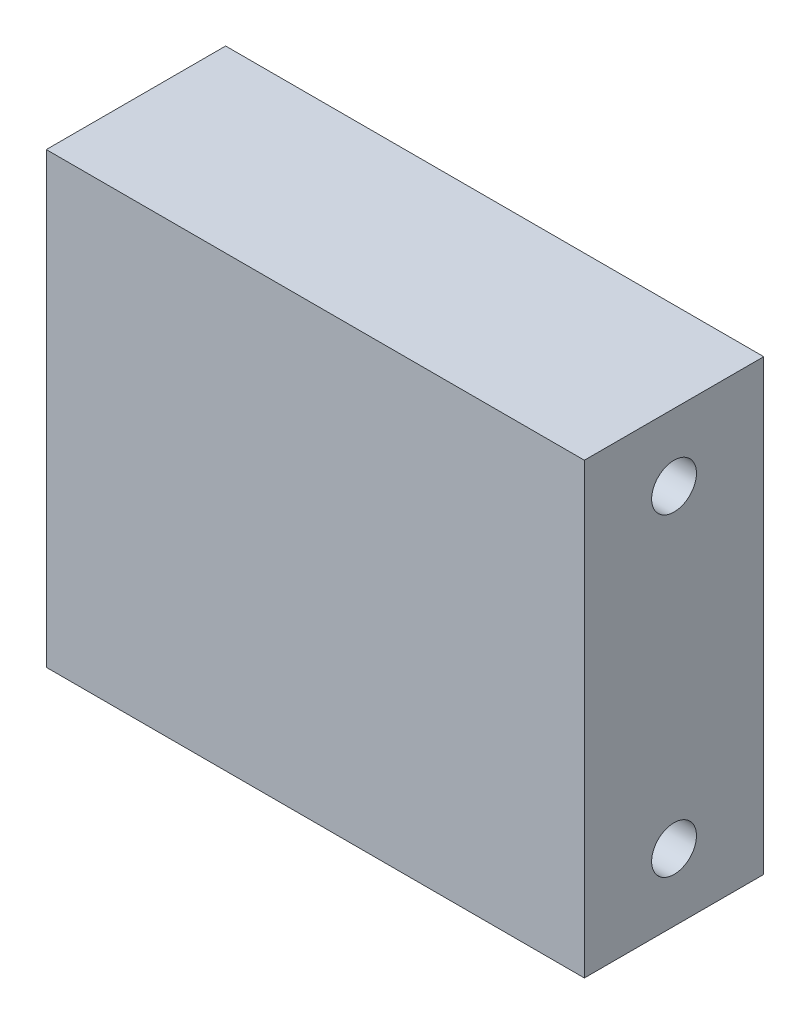
ISO-10303-21;
HEADER;
FILE_DESCRIPTION(('STEP AP214'),'2;1');
FILE_NAME('part.step','',(''),(''),'','','');
FILE_SCHEMA(('AUTOMOTIVE_DESIGN { 1 0 10303 214 1 1 1 1 }'));
ENDSEC;
DATA;
#1=APPLICATION_CONTEXT('core data for automotive mechanical design processes');
#2=APPLICATION_PROTOCOL_DEFINITION('international standard','automotive_design',2000,#1);
#3=PRODUCT_CONTEXT('',#1,'mechanical');
#4=PRODUCT('Part','Part','',(#3));
#5=PRODUCT_RELATED_PRODUCT_CATEGORY('part','',(#4));
#6=PRODUCT_DEFINITION_FORMATION('','',#4);
#7=PRODUCT_DEFINITION_CONTEXT('part definition',#1,'design');
#8=PRODUCT_DEFINITION('design','',#6,#7);
#9=PRODUCT_DEFINITION_SHAPE('','',#8);
#10=(LENGTH_UNIT() NAMED_UNIT(*) SI_UNIT(.MILLI.,.METRE.));
#11=(NAMED_UNIT(*) PLANE_ANGLE_UNIT() SI_UNIT($,.RADIAN.));
#12=(NAMED_UNIT(*) SI_UNIT($,.STERADIAN.) SOLID_ANGLE_UNIT());
#13=UNCERTAINTY_MEASURE_WITH_UNIT(LENGTH_MEASURE(1.E-05),#10,'distance_accuracy_value','');
#14=(GEOMETRIC_REPRESENTATION_CONTEXT(3) GLOBAL_UNCERTAINTY_ASSIGNED_CONTEXT((#13)) GLOBAL_UNIT_ASSIGNED_CONTEXT((#10,
#11,#12)) REPRESENTATION_CONTEXT('',''));
#15=CARTESIAN_POINT('',(0.,0.,0.));
#16=DIRECTION('',(0.,0.,1.));
#17=DIRECTION('',(1.,0.,0.));
#18=AXIS2_PLACEMENT_3D('',#15,#16,#17);
#19=CARTESIAN_POINT('',(0.,127.,0.));
#20=DIRECTION('',(1.,0.,0.));
#21=DIRECTION('',(0.,0.,-1.));
#22=AXIS2_PLACEMENT_3D('',#19,#20,#21);
#23=PLANE('',#22);
#24=CARTESIAN_POINT('',(0.,19.05,-25.4));
#25=DIRECTION('',(-1.,0.,0.));
#26=DIRECTION('',(0.,0.,1.));
#27=AXIS2_PLACEMENT_3D('',#24,#25,#26);
#28=CIRCLE('',#27,6.35);
#29=CARTESIAN_POINT('',(0.,19.05,-19.05));
#30=VERTEX_POINT('',#29);
#31=EDGE_CURVE('E116',#30,#30,#28,.T.);
#32=ORIENTED_EDGE('',*,*,#31,.F.);
#33=EDGE_LOOP('',(#32));
#34=FACE_BOUND('',#33,.T.);
#35=CARTESIAN_POINT('',(0.,107.95,-25.4));
#36=DIRECTION('',(-1.,0.,0.));
#37=DIRECTION('',(0.,0.,-1.));
#38=AXIS2_PLACEMENT_3D('',#35,#36,#37);
#39=CIRCLE('',#38,6.35);
#40=CARTESIAN_POINT('',(0.,107.95,-31.75));
#41=VERTEX_POINT('',#40);
#42=EDGE_CURVE('E110',#41,#41,#39,.T.);
#43=ORIENTED_EDGE('',*,*,#42,.F.);
#44=EDGE_LOOP('',(#43));
#45=FACE_BOUND('',#44,.T.);
#46=DIRECTION('',(0.,0.,1.));
#47=VECTOR('',#46,1.);
#48=CARTESIAN_POINT('',(0.,0.,0.));
#49=LINE('',#48,#47);
#50=CARTESIAN_POINT('',(0.,0.,-50.8));
#51=VERTEX_POINT('',#50);
#52=CARTESIAN_POINT('',(0.,0.,0.));
#53=VERTEX_POINT('',#52);
#54=EDGE_CURVE('E96',#51,#53,#49,.T.);
#55=ORIENTED_EDGE('',*,*,#54,.T.);
#56=DIRECTION('',(0.,-1.,0.));
#57=VECTOR('',#56,1.);
#58=CARTESIAN_POINT('',(0.,127.,0.));
#59=LINE('',#58,#57);
#60=CARTESIAN_POINT('',(0.,127.,0.));
#61=VERTEX_POINT('',#60);
#62=EDGE_CURVE('E11',#61,#53,#59,.T.);
#63=ORIENTED_EDGE('',*,*,#62,.F.);
#64=DIRECTION('',(0.,0.,1.));
#65=VECTOR('',#64,1.);
#66=CARTESIAN_POINT('',(0.,127.,0.));
#67=LINE('',#66,#65);
#68=CARTESIAN_POINT('',(0.,127.,-50.8));
#69=VERTEX_POINT('',#68);
#70=EDGE_CURVE('E84',#69,#61,#67,.T.);
#71=ORIENTED_EDGE('',*,*,#70,.F.);
#72=DIRECTION('',(0.,-1.,0.));
#73=VECTOR('',#72,1.);
#74=CARTESIAN_POINT('',(0.,127.,-50.8));
#75=LINE('',#74,#73);
#76=EDGE_CURVE('E92',#69,#51,#75,.T.);
#77=ORIENTED_EDGE('',*,*,#76,.T.);
#78=EDGE_LOOP('',(#55,#63,#71,#77));
#79=FACE_BOUND('',#78,.T.);
#80=ADVANCED_FACE('F33',(#34,#45,#79),#23,.F.);
#81=CARTESIAN_POINT('',(0.,127.,0.));
#82=DIRECTION('',(0.,0.,-1.));
#83=DIRECTION('',(-1.,0.,0.));
#84=AXIS2_PLACEMENT_3D('',#81,#82,#83);
#85=PLANE('',#84);
#86=DIRECTION('',(1.,0.,0.));
#87=VECTOR('',#86,1.);
#88=CARTESIAN_POINT('',(0.,0.,0.));
#89=LINE('',#88,#87);
#90=CARTESIAN_POINT('',(152.4,0.,0.));
#91=VERTEX_POINT('',#90);
#92=EDGE_CURVE('E88',#53,#91,#89,.T.);
#93=ORIENTED_EDGE('',*,*,#92,.T.);
#94=DIRECTION('',(0.,-1.,0.));
#95=VECTOR('',#94,1.);
#96=CARTESIAN_POINT('',(152.4,127.,0.));
#97=LINE('',#96,#95);
#98=CARTESIAN_POINT('',(152.4,127.,0.));
#99=VERTEX_POINT('',#98);
#100=EDGE_CURVE('E41',#99,#91,#97,.T.);
#101=ORIENTED_EDGE('',*,*,#100,.F.);
#102=DIRECTION('',(1.,0.,0.));
#103=VECTOR('',#102,1.);
#104=CARTESIAN_POINT('',(0.,127.,0.));
#105=LINE('',#104,#103);
#106=EDGE_CURVE('E79',#61,#99,#105,.T.);
#107=ORIENTED_EDGE('',*,*,#106,.F.);
#108=ORIENTED_EDGE('',*,*,#62,.T.);
#109=EDGE_LOOP('',(#93,#101,#107,#108));
#110=FACE_BOUND('',#109,.T.);
#111=ADVANCED_FACE('F87',(#110),#85,.F.);
#112=CARTESIAN_POINT('',(152.4,127.,0.));
#113=DIRECTION('',(-1.,0.,0.));
#114=DIRECTION('',(0.,0.,1.));
#115=AXIS2_PLACEMENT_3D('',#112,#113,#114);
#116=PLANE('',#115);
#117=CARTESIAN_POINT('',(152.4,19.05,-25.4));
#118=DIRECTION('',(-1.,0.,0.));
#119=DIRECTION('',(0.,0.,1.));
#120=AXIS2_PLACEMENT_3D('',#117,#118,#119);
#121=CIRCLE('',#120,6.35);
#122=CARTESIAN_POINT('',(152.4,19.05,-19.05));
#123=VERTEX_POINT('',#122);
#124=EDGE_CURVE('E99',#123,#123,#121,.T.);
#125=ORIENTED_EDGE('',*,*,#124,.T.);
#126=EDGE_LOOP('',(#125));
#127=FACE_BOUND('',#126,.T.);
#128=CARTESIAN_POINT('',(152.4,107.95,-25.4));
#129=DIRECTION('',(-1.,0.,0.));
#130=DIRECTION('',(0.,0.,-1.));
#131=AXIS2_PLACEMENT_3D('',#128,#129,#130);
#132=CIRCLE('',#131,6.35);
#133=CARTESIAN_POINT('',(152.4,107.95,-31.75));
#134=VERTEX_POINT('',#133);
#135=EDGE_CURVE('E113',#134,#134,#132,.T.);
#136=ORIENTED_EDGE('',*,*,#135,.T.);
#137=EDGE_LOOP('',(#136));
#138=FACE_BOUND('',#137,.T.);
#139=DIRECTION('',(0.,0.,-1.));
#140=VECTOR('',#139,1.);
#141=CARTESIAN_POINT('',(152.4,0.,0.));
#142=LINE('',#141,#140);
#143=CARTESIAN_POINT('',(152.4,0.,-50.8));
#144=VERTEX_POINT('',#143);
#145=EDGE_CURVE('E66',#91,#144,#142,.T.);
#146=ORIENTED_EDGE('',*,*,#145,.T.);
#147=DIRECTION('',(0.,-1.,0.));
#148=VECTOR('',#147,1.);
#149=CARTESIAN_POINT('',(152.4,127.,-50.8));
#150=LINE('',#149,#148);
#151=CARTESIAN_POINT('',(152.4,127.,-50.8));
#152=VERTEX_POINT('',#151);
#153=EDGE_CURVE('E89',#152,#144,#150,.T.);
#154=ORIENTED_EDGE('',*,*,#153,.F.);
#155=DIRECTION('',(0.,0.,-1.));
#156=VECTOR('',#155,1.);
#157=CARTESIAN_POINT('',(152.4,127.,0.));
#158=LINE('',#157,#156);
#159=EDGE_CURVE('E82',#99,#152,#158,.T.);
#160=ORIENTED_EDGE('',*,*,#159,.F.);
#161=ORIENTED_EDGE('',*,*,#100,.T.);
#162=EDGE_LOOP('',(#146,#154,#160,#161));
#163=FACE_BOUND('',#162,.T.);
#164=ADVANCED_FACE('F90',(#127,#138,#163),#116,.F.);
#165=CARTESIAN_POINT('',(0.,127.,-50.8));
#166=DIRECTION('',(0.,0.,1.));
#167=DIRECTION('',(1.,0.,0.));
#168=AXIS2_PLACEMENT_3D('',#165,#166,#167);
#169=PLANE('',#168);
#170=DIRECTION('',(-1.,0.,0.));
#171=VECTOR('',#170,1.);
#172=CARTESIAN_POINT('',(0.,0.,-50.8));
#173=LINE('',#172,#171);
#174=EDGE_CURVE('E72',#144,#51,#173,.T.);
#175=ORIENTED_EDGE('',*,*,#174,.T.);
#176=ORIENTED_EDGE('',*,*,#76,.F.);
#177=DIRECTION('',(-1.,0.,0.));
#178=VECTOR('',#177,1.);
#179=CARTESIAN_POINT('',(0.,127.,-50.8));
#180=LINE('',#179,#178);
#181=EDGE_CURVE('E49',#152,#69,#180,.T.);
#182=ORIENTED_EDGE('',*,*,#181,.F.);
#183=ORIENTED_EDGE('',*,*,#153,.T.);
#184=EDGE_LOOP('',(#175,#176,#182,#183));
#185=FACE_BOUND('',#184,.T.);
#186=ADVANCED_FACE('F104',(#185),#169,.F.);
#187=CARTESIAN_POINT('',(0.,127.,0.));
#188=DIRECTION('',(0.,-1.,0.));
#189=DIRECTION('',(0.,0.,-1.));
#190=AXIS2_PLACEMENT_3D('',#187,#188,#189);
#191=PLANE('',#190);
#192=ORIENTED_EDGE('',*,*,#70,.T.);
#193=ORIENTED_EDGE('',*,*,#106,.T.);
#194=ORIENTED_EDGE('',*,*,#159,.T.);
#195=ORIENTED_EDGE('',*,*,#181,.T.);
#196=EDGE_LOOP('',(#192,#193,#194,#195));
#197=FACE_BOUND('',#196,.T.);
#198=ADVANCED_FACE('F80',(#197),#191,.F.);
#199=CARTESIAN_POINT('',(0.,0.,0.));
#200=DIRECTION('',(0.,-1.,0.));
#201=DIRECTION('',(0.,0.,-1.));
#202=AXIS2_PLACEMENT_3D('',#199,#200,#201);
#203=PLANE('',#202);
#204=ORIENTED_EDGE('',*,*,#54,.F.);
#205=ORIENTED_EDGE('',*,*,#174,.F.);
#206=ORIENTED_EDGE('',*,*,#145,.F.);
#207=ORIENTED_EDGE('',*,*,#92,.F.);
#208=EDGE_LOOP('',(#204,#205,#206,#207));
#209=FACE_BOUND('',#208,.T.);
#210=ADVANCED_FACE('F107',(#209),#203,.T.);
#211=CARTESIAN_POINT('',(152.4,107.95,-25.4));
#212=DIRECTION('',(-1.,0.,0.));
#213=DIRECTION('',(0.,0.,1.));
#214=AXIS2_PLACEMENT_3D('',#211,#212,#213);
#215=CYLINDRICAL_SURFACE('',#214,6.35);
#216=ORIENTED_EDGE('',*,*,#135,.F.);
#217=EDGE_LOOP('',(#216));
#218=FACE_BOUND('',#217,.T.);
#219=ORIENTED_EDGE('',*,*,#42,.T.);
#220=EDGE_LOOP('',(#219));
#221=FACE_BOUND('',#220,.T.);
#222=ADVANCED_FACE('F127',(#218,#221),#215,.F.);
#223=CARTESIAN_POINT('',(152.4,19.05,-25.4));
#224=DIRECTION('',(-1.,0.,0.));
#225=DIRECTION('',(0.,0.,1.));
#226=AXIS2_PLACEMENT_3D('',#223,#224,#225);
#227=CYLINDRICAL_SURFACE('',#226,6.35);
#228=ORIENTED_EDGE('',*,*,#124,.F.);
#229=EDGE_LOOP('',(#228));
#230=FACE_BOUND('',#229,.T.);
#231=ORIENTED_EDGE('',*,*,#31,.T.);
#232=EDGE_LOOP('',(#231));
#233=FACE_BOUND('',#232,.T.);
#234=ADVANCED_FACE('F124',(#230,#233),#227,.F.);
#235=CLOSED_SHELL('',(#80,#111,#164,#186,#198,#210,#222,#234));
#236=MANIFOLD_SOLID_BREP('B2',#235);
#237=ADVANCED_BREP_SHAPE_REPRESENTATION('',(#18,#236),#14);
#238=SHAPE_DEFINITION_REPRESENTATION(#9,#237);
ENDSEC;
END-ISO-10303-21;
